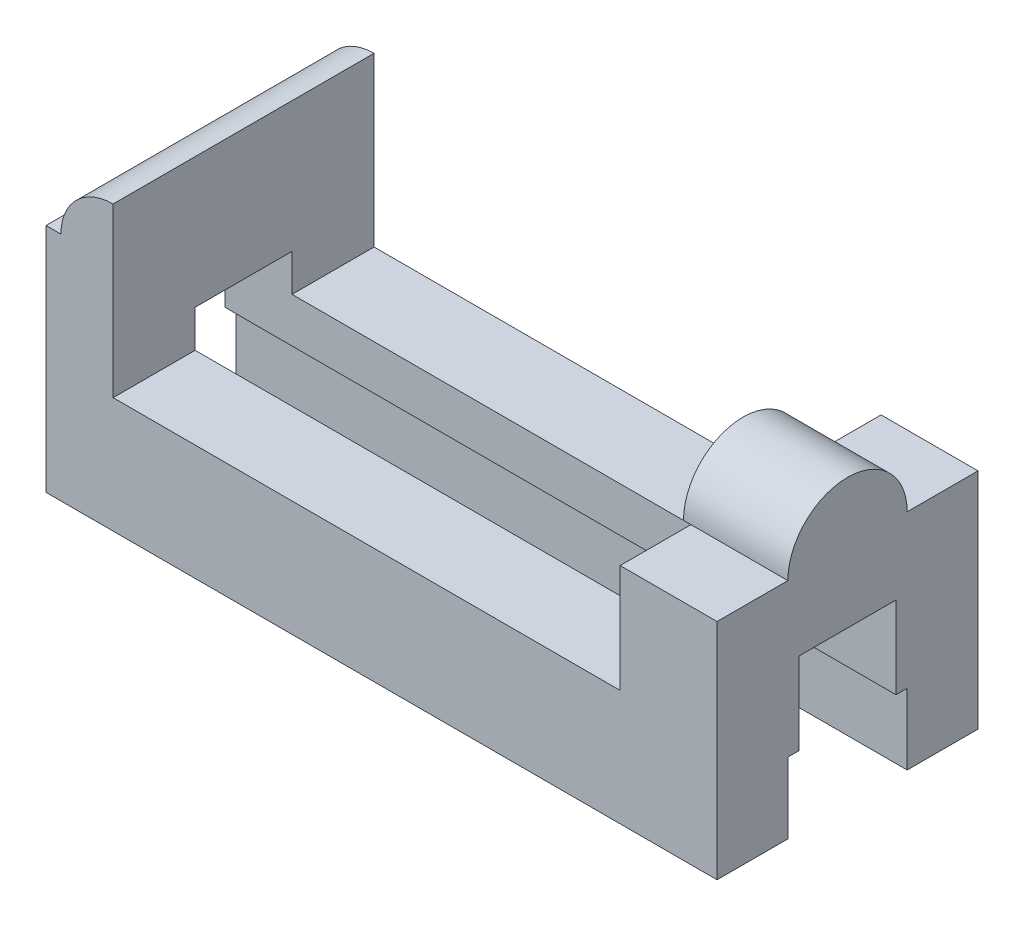
ISO-10303-21;
HEADER;
FILE_DESCRIPTION(('STEP AP214'),'2;1');
FILE_NAME('part.step','',(''),(''),'','','');
FILE_SCHEMA(('AUTOMOTIVE_DESIGN { 1 0 10303 214 1 1 1 1 }'));
ENDSEC;
DATA;
#1=APPLICATION_CONTEXT('core data for automotive mechanical design processes');
#2=APPLICATION_PROTOCOL_DEFINITION('international standard','automotive_design',2000,#1);
#3=PRODUCT_CONTEXT('',#1,'mechanical');
#4=PRODUCT('Part','Part','',(#3));
#5=PRODUCT_RELATED_PRODUCT_CATEGORY('part','',(#4));
#6=PRODUCT_DEFINITION_FORMATION('','',#4);
#7=PRODUCT_DEFINITION_CONTEXT('part definition',#1,'design');
#8=PRODUCT_DEFINITION('design','',#6,#7);
#9=PRODUCT_DEFINITION_SHAPE('','',#8);
#10=(LENGTH_UNIT() NAMED_UNIT(*) SI_UNIT(.MILLI.,.METRE.));
#11=(NAMED_UNIT(*) PLANE_ANGLE_UNIT() SI_UNIT($,.RADIAN.));
#12=(NAMED_UNIT(*) SI_UNIT($,.STERADIAN.) SOLID_ANGLE_UNIT());
#13=UNCERTAINTY_MEASURE_WITH_UNIT(LENGTH_MEASURE(1.E-05),#10,'distance_accuracy_value','');
#14=(GEOMETRIC_REPRESENTATION_CONTEXT(3) GLOBAL_UNCERTAINTY_ASSIGNED_CONTEXT((#13)) GLOBAL_UNIT_ASSIGNED_CONTEXT((#10,
#11,#12)) REPRESENTATION_CONTEXT('',''));
#15=CARTESIAN_POINT('',(0.,0.,0.));
#16=DIRECTION('',(0.,0.,1.));
#17=DIRECTION('',(1.,0.,0.));
#18=AXIS2_PLACEMENT_3D('',#15,#16,#17);
#19=CARTESIAN_POINT('',(20.,22.,35.));
#20=DIRECTION('',(0.,-1.,0.));
#21=DIRECTION('',(0.,0.,-1.));
#22=AXIS2_PLACEMENT_3D('',#19,#20,#21);
#23=PLANE('',#22);
#24=DIRECTION('',(0.,0.,1.));
#25=VECTOR('',#24,1.);
#26=CARTESIAN_POINT('',(64.,22.,35.));
#27=LINE('',#26,#25);
#28=CARTESIAN_POINT('',(64.,22.,-35.));
#29=VERTEX_POINT('',#28);
#30=CARTESIAN_POINT('',(64.,22.,-16.));
#31=VERTEX_POINT('',#30);
#32=EDGE_CURVE('E221',#29,#31,#27,.T.);
#33=ORIENTED_EDGE('',*,*,#32,.T.);
#34=DIRECTION('',(1.,0.,0.));
#35=VECTOR('',#34,1.);
#36=CARTESIAN_POINT('',(62.,22.,-16.));
#37=LINE('',#36,#35);
#38=CARTESIAN_POINT('',(90.,22.,-16.));
#39=VERTEX_POINT('',#38);
#40=EDGE_CURVE('E11',#31,#39,#37,.T.);
#41=ORIENTED_EDGE('',*,*,#40,.T.);
#42=DIRECTION('',(0.,0.,-1.));
#43=VECTOR('',#42,1.);
#44=CARTESIAN_POINT('',(90.,22.,35.));
#45=LINE('',#44,#43);
#46=CARTESIAN_POINT('',(90.,22.,-35.));
#47=VERTEX_POINT('',#46);
#48=EDGE_CURVE('E215',#39,#47,#45,.T.);
#49=ORIENTED_EDGE('',*,*,#48,.T.);
#50=DIRECTION('',(1.,0.,0.));
#51=VECTOR('',#50,1.);
#52=CARTESIAN_POINT('',(0.,22.,-35.));
#53=LINE('',#52,#51);
#54=EDGE_CURVE('E376',#29,#47,#53,.T.);
#55=ORIENTED_EDGE('',*,*,#54,.F.);
#56=EDGE_LOOP('',(#33,#41,#49,#55));
#57=FACE_BOUND('',#56,.T.);
#58=ADVANCED_FACE('F33',(#57),#23,.F.);
#59=CARTESIAN_POINT('',(-90.,-38.,35.));
#60=DIRECTION('',(0.,1.,0.));
#61=DIRECTION('',(0.,0.,1.));
#62=AXIS2_PLACEMENT_3D('',#59,#60,#61);
#63=PLANE('',#62);
#64=DIRECTION('',(0.,0.,-1.));
#65=VECTOR('',#64,1.);
#66=CARTESIAN_POINT('',(-90.,-38.,35.));
#67=LINE('',#66,#65);
#68=CARTESIAN_POINT('',(-90.,-38.,35.));
#69=VERTEX_POINT('',#68);
#70=CARTESIAN_POINT('',(-90.,-38.,16.));
#71=VERTEX_POINT('',#70);
#72=EDGE_CURVE('E359',#69,#71,#67,.T.);
#73=ORIENTED_EDGE('',*,*,#72,.T.);
#74=DIRECTION('',(1.,0.,0.));
#75=VECTOR('',#74,1.);
#76=CARTESIAN_POINT('',(-90.,-38.,16.));
#77=LINE('',#76,#75);
#78=CARTESIAN_POINT('',(89.9999999999999,-38.,16.));
#79=VERTEX_POINT('',#78);
#80=EDGE_CURVE('E261',#71,#79,#77,.T.);
#81=ORIENTED_EDGE('',*,*,#80,.T.);
#82=DIRECTION('',(0.,0.,-1.));
#83=VECTOR('',#82,1.);
#84=CARTESIAN_POINT('',(90.,-38.,35.));
#85=LINE('',#84,#83);
#86=CARTESIAN_POINT('',(90.,-38.,35.));
#87=VERTEX_POINT('',#86);
#88=EDGE_CURVE('E373',#87,#79,#85,.T.);
#89=ORIENTED_EDGE('',*,*,#88,.F.);
#90=DIRECTION('',(1.,0.,0.));
#91=VECTOR('',#90,1.);
#92=CARTESIAN_POINT('',(-90.,-38.,35.));
#93=LINE('',#92,#91);
#94=EDGE_CURVE('E323',#69,#87,#93,.T.);
#95=ORIENTED_EDGE('',*,*,#94,.F.);
#96=EDGE_LOOP('',(#73,#81,#89,#95));
#97=FACE_BOUND('',#96,.T.);
#98=ADVANCED_FACE('F427',(#97),#63,.F.);
#99=CARTESIAN_POINT('',(-72.,-6.99999999999999,35.));
#100=DIRECTION('',(0.,1.,0.));
#101=DIRECTION('',(0.,0.,1.));
#102=AXIS2_PLACEMENT_3D('',#99,#100,#101);
#103=PLANE('',#102);
#104=DIRECTION('',(1.,0.,0.));
#105=VECTOR('',#104,1.);
#106=CARTESIAN_POINT('',(-72.,-6.99999999999999,13.));
#107=LINE('',#106,#105);
#108=CARTESIAN_POINT('',(-72.,-6.99999999999999,13.));
#109=VERTEX_POINT('',#108);
#110=CARTESIAN_POINT('',(64.,-6.99999999999999,13.));
#111=VERTEX_POINT('',#110);
#112=EDGE_CURVE('E309',#109,#111,#107,.T.);
#113=ORIENTED_EDGE('',*,*,#112,.F.);
#114=DIRECTION('',(0.,0.,-1.));
#115=VECTOR('',#114,1.);
#116=CARTESIAN_POINT('',(-72.,-6.99999999999999,35.));
#117=LINE('',#116,#115);
#118=CARTESIAN_POINT('',(-72.,-6.99999999999999,35.));
#119=VERTEX_POINT('',#118);
#120=EDGE_CURVE('E365',#119,#109,#117,.T.);
#121=ORIENTED_EDGE('',*,*,#120,.F.);
#122=DIRECTION('',(1.,0.,0.));
#123=VECTOR('',#122,1.);
#124=CARTESIAN_POINT('',(-72.,-6.99999999999999,35.));
#125=LINE('',#124,#123);
#126=CARTESIAN_POINT('',(64.,-6.99999999999999,35.));
#127=VERTEX_POINT('',#126);
#128=EDGE_CURVE('E333',#119,#127,#125,.T.);
#129=ORIENTED_EDGE('',*,*,#128,.T.);
#130=DIRECTION('',(0.,0.,-1.));
#131=VECTOR('',#130,1.);
#132=CARTESIAN_POINT('',(64.,-6.99999999999999,35.));
#133=LINE('',#132,#131);
#134=EDGE_CURVE('E369',#127,#111,#133,.T.);
#135=ORIENTED_EDGE('',*,*,#134,.T.);
#136=EDGE_LOOP('',(#113,#121,#129,#135));
#137=FACE_BOUND('',#136,.T.);
#138=ADVANCED_FACE('F449',(#137),#103,.T.);
#139=CARTESIAN_POINT('',(89.9999999999999,-38.,-16.));
#140=VERTEX_POINT('',#139);
#141=CARTESIAN_POINT('',(90.,-38.,-35.));
#142=VERTEX_POINT('',#141);
#143=EDGE_CURVE('E372',#140,#142,#85,.T.);
#144=ORIENTED_EDGE('',*,*,#143,.F.);
#145=DIRECTION('',(1.,0.,0.));
#146=VECTOR('',#145,1.);
#147=CARTESIAN_POINT('',(-90.,-38.,-16.));
#148=LINE('',#147,#146);
#149=CARTESIAN_POINT('',(-90.,-38.,-16.));
#150=VERTEX_POINT('',#149);
#151=EDGE_CURVE('E260',#150,#140,#148,.T.);
#152=ORIENTED_EDGE('',*,*,#151,.F.);
#153=CARTESIAN_POINT('',(-90.,-38.,-35.));
#154=VERTEX_POINT('',#153);
#155=EDGE_CURVE('E342',#150,#154,#67,.T.);
#156=ORIENTED_EDGE('',*,*,#155,.T.);
#157=DIRECTION('',(1.,0.,0.));
#158=VECTOR('',#157,1.);
#159=CARTESIAN_POINT('',(-90.,-38.,-35.));
#160=LINE('',#159,#158);
#161=EDGE_CURVE('E322',#154,#142,#160,.T.);
#162=ORIENTED_EDGE('',*,*,#161,.T.);
#163=EDGE_LOOP('',(#144,#152,#156,#162));
#164=FACE_BOUND('',#163,.T.);
#165=ADVANCED_FACE('F35',(#164),#63,.F.);
#166=CARTESIAN_POINT('',(90.,-38.,35.));
#167=DIRECTION('',(-1.,0.,0.));
#168=DIRECTION('',(0.,0.,1.));
#169=AXIS2_PLACEMENT_3D('',#166,#167,#168);
#170=PLANE('',#169);
#171=DIRECTION('',(0.,1.,0.));
#172=VECTOR('',#171,1.);
#173=CARTESIAN_POINT('',(90.,-38.,-35.));
#174=LINE('',#173,#172);
#175=EDGE_CURVE('E345',#142,#47,#174,.T.);
#176=ORIENTED_EDGE('',*,*,#175,.T.);
#177=ORIENTED_EDGE('',*,*,#48,.F.);
#178=CARTESIAN_POINT('',(90.,22.,0.));
#179=DIRECTION('',(1.,0.,0.));
#180=DIRECTION('',(0.,0.,-1.));
#181=AXIS2_PLACEMENT_3D('',#178,#179,#180);
#182=CIRCLE('',#181,16.);
#183=CARTESIAN_POINT('',(90.,22.,16.));
#184=VERTEX_POINT('',#183);
#185=EDGE_CURVE('E208',#39,#184,#182,.T.);
#186=ORIENTED_EDGE('',*,*,#185,.T.);
#187=CARTESIAN_POINT('',(90.,22.,35.));
#188=VERTEX_POINT('',#187);
#189=EDGE_CURVE('E48',#188,#184,#45,.T.);
#190=ORIENTED_EDGE('',*,*,#189,.F.);
#191=DIRECTION('',(0.,1.,0.));
#192=VECTOR('',#191,1.);
#193=CARTESIAN_POINT('',(90.,-38.,35.));
#194=LINE('',#193,#192);
#195=EDGE_CURVE('E326',#87,#188,#194,.T.);
#196=ORIENTED_EDGE('',*,*,#195,.F.);
#197=ORIENTED_EDGE('',*,*,#88,.T.);
#198=DIRECTION('',(0.,1.,0.));
#199=VECTOR('',#198,1.);
#200=CARTESIAN_POINT('',(90.,-38.,16.));
#201=LINE('',#200,#199);
#202=CARTESIAN_POINT('',(89.9999999999999,-19.,16.));
#203=VERTEX_POINT('',#202);
#204=EDGE_CURVE('E319',#79,#203,#201,.T.);
#205=ORIENTED_EDGE('',*,*,#204,.T.);
#206=DIRECTION('',(0.,0.,-1.));
#207=VECTOR('',#206,1.);
#208=CARTESIAN_POINT('',(90.,-19.,35.));
#209=LINE('',#208,#207);
#210=CARTESIAN_POINT('',(89.9999999999999,-19.,13.));
#211=VERTEX_POINT('',#210);
#212=EDGE_CURVE('E316',#203,#211,#209,.T.);
#213=ORIENTED_EDGE('',*,*,#212,.T.);
#214=DIRECTION('',(0.,1.,0.));
#215=VECTOR('',#214,1.);
#216=CARTESIAN_POINT('',(90.,-38.,13.));
#217=LINE('',#216,#215);
#218=CARTESIAN_POINT('',(89.9999999999999,3.,13.));
#219=VERTEX_POINT('',#218);
#220=EDGE_CURVE('E313',#211,#219,#217,.T.);
#221=ORIENTED_EDGE('',*,*,#220,.T.);
#222=DIRECTION('',(0.,0.,-1.));
#223=VECTOR('',#222,1.);
#224=CARTESIAN_POINT('',(90.,3.,35.));
#225=LINE('',#224,#223);
#226=CARTESIAN_POINT('',(89.9999999999999,3.00000000000001,-13.));
#227=VERTEX_POINT('',#226);
#228=EDGE_CURVE('E304',#219,#227,#225,.T.);
#229=ORIENTED_EDGE('',*,*,#228,.T.);
#230=DIRECTION('',(0.,-1.,0.));
#231=VECTOR('',#230,1.);
#232=CARTESIAN_POINT('',(90.,-38.,-13.));
#233=LINE('',#232,#231);
#234=CARTESIAN_POINT('',(89.9999999999999,-19.,-13.));
#235=VERTEX_POINT('',#234);
#236=EDGE_CURVE('E297',#227,#235,#233,.T.);
#237=ORIENTED_EDGE('',*,*,#236,.T.);
#238=DIRECTION('',(0.,0.,-1.));
#239=VECTOR('',#238,1.);
#240=CARTESIAN_POINT('',(90.,-19.,35.));
#241=LINE('',#240,#239);
#242=CARTESIAN_POINT('',(89.9999999999999,-19.,-16.));
#243=VERTEX_POINT('',#242);
#244=EDGE_CURVE('E288',#235,#243,#241,.T.);
#245=ORIENTED_EDGE('',*,*,#244,.T.);
#246=DIRECTION('',(0.,-1.,0.));
#247=VECTOR('',#246,1.);
#248=CARTESIAN_POINT('',(90.,-38.,-16.));
#249=LINE('',#248,#247);
#250=EDGE_CURVE('E264',#243,#140,#249,.T.);
#251=ORIENTED_EDGE('',*,*,#250,.T.);
#252=ORIENTED_EDGE('',*,*,#143,.T.);
#253=EDGE_LOOP('',(#176,#177,#186,#190,#196,#197,#205,#213,#221,#229,#237,#245,#251,#252));
#254=FACE_BOUND('',#253,.T.);
#255=ADVANCED_FACE('F386',(#254),#170,.F.);
#256=CARTESIAN_POINT('',(64.,-6.99999999999999,35.));
#257=DIRECTION('',(-1.,0.,0.));
#258=DIRECTION('',(0.,0.,1.));
#259=AXIS2_PLACEMENT_3D('',#256,#257,#258);
#260=PLANE('',#259);
#261=ORIENTED_EDGE('',*,*,#32,.F.);
#262=DIRECTION('',(0.,1.,0.));
#263=VECTOR('',#262,1.);
#264=CARTESIAN_POINT('',(64.,-6.99999999999999,-35.));
#265=LINE('',#264,#263);
#266=CARTESIAN_POINT('',(64.,-6.99999999999999,-35.));
#267=VERTEX_POINT('',#266);
#268=EDGE_CURVE('E348',#267,#29,#265,.T.);
#269=ORIENTED_EDGE('',*,*,#268,.F.);
#270=CARTESIAN_POINT('',(64.,-6.99999999999999,-13.));
#271=VERTEX_POINT('',#270);
#272=EDGE_CURVE('E368',#271,#267,#133,.T.);
#273=ORIENTED_EDGE('',*,*,#272,.F.);
#274=DIRECTION('',(0.,-1.,0.));
#275=VECTOR('',#274,1.);
#276=CARTESIAN_POINT('',(64.,-6.99999999999999,-13.));
#277=LINE('',#276,#275);
#278=CARTESIAN_POINT('',(63.9999999999999,3.00000000000001,-13.));
#279=VERTEX_POINT('',#278);
#280=EDGE_CURVE('E295',#279,#271,#277,.T.);
#281=ORIENTED_EDGE('',*,*,#280,.F.);
#282=DIRECTION('',(0.,0.,-1.));
#283=VECTOR('',#282,1.);
#284=CARTESIAN_POINT('',(64.,3.,35.));
#285=LINE('',#284,#283);
#286=CARTESIAN_POINT('',(63.9999999999999,3.,13.));
#287=VERTEX_POINT('',#286);
#288=EDGE_CURVE('E302',#287,#279,#285,.T.);
#289=ORIENTED_EDGE('',*,*,#288,.F.);
#290=DIRECTION('',(0.,1.,0.));
#291=VECTOR('',#290,1.);
#292=CARTESIAN_POINT('',(64.,-6.99999999999999,13.));
#293=LINE('',#292,#291);
#294=EDGE_CURVE('E311',#111,#287,#293,.T.);
#295=ORIENTED_EDGE('',*,*,#294,.F.);
#296=ORIENTED_EDGE('',*,*,#134,.F.);
#297=DIRECTION('',(0.,1.,0.));
#298=VECTOR('',#297,1.);
#299=CARTESIAN_POINT('',(64.,-6.99999999999999,35.));
#300=LINE('',#299,#298);
#301=CARTESIAN_POINT('',(64.,22.,35.));
#302=VERTEX_POINT('',#301);
#303=EDGE_CURVE('E330',#127,#302,#300,.T.);
#304=ORIENTED_EDGE('',*,*,#303,.T.);
#305=CARTESIAN_POINT('',(64.,22.,16.));
#306=VERTEX_POINT('',#305);
#307=EDGE_CURVE('E220',#306,#302,#27,.T.);
#308=ORIENTED_EDGE('',*,*,#307,.F.);
#309=EDGE_CURVE('E198',#31,#306,#27,.T.);
#310=ORIENTED_EDGE('',*,*,#309,.F.);
#311=EDGE_LOOP('',(#261,#269,#273,#281,#289,#295,#296,#304,#308,#310));
#312=FACE_BOUND('',#311,.T.);
#313=ADVANCED_FACE('F422',(#312),#260,.T.);
#314=DIRECTION('',(-1.,0.,0.));
#315=VECTOR('',#314,1.);
#316=CARTESIAN_POINT('',(-72.,-6.99999999999999,-13.));
#317=LINE('',#316,#315);
#318=CARTESIAN_POINT('',(-72.,-6.99999999999999,-13.));
#319=VERTEX_POINT('',#318);
#320=EDGE_CURVE('E293',#271,#319,#317,.T.);
#321=ORIENTED_EDGE('',*,*,#320,.F.);
#322=ORIENTED_EDGE('',*,*,#272,.T.);
#323=DIRECTION('',(1.,0.,0.));
#324=VECTOR('',#323,1.);
#325=CARTESIAN_POINT('',(-72.,-6.99999999999999,-35.));
#326=LINE('',#325,#324);
#327=CARTESIAN_POINT('',(-72.,-6.99999999999999,-35.));
#328=VERTEX_POINT('',#327);
#329=EDGE_CURVE('E351',#328,#267,#326,.T.);
#330=ORIENTED_EDGE('',*,*,#329,.F.);
#331=EDGE_CURVE('E364',#319,#328,#117,.T.);
#332=ORIENTED_EDGE('',*,*,#331,.F.);
#333=EDGE_LOOP('',(#321,#322,#330,#332));
#334=FACE_BOUND('',#333,.T.);
#335=ADVANCED_FACE('F418',(#334),#103,.T.);
#336=CARTESIAN_POINT('',(-72.,38.,35.));
#337=DIRECTION('',(1.,0.,0.));
#338=DIRECTION('',(0.,0.,-1.));
#339=AXIS2_PLACEMENT_3D('',#336,#337,#338);
#340=PLANE('',#339);
#341=DIRECTION('',(0.,-1.,0.));
#342=VECTOR('',#341,1.);
#343=CARTESIAN_POINT('',(-72.,38.,13.));
#344=LINE('',#343,#342);
#345=CARTESIAN_POINT('',(-72.,3.,13.));
#346=VERTEX_POINT('',#345);
#347=EDGE_CURVE('E307',#346,#109,#344,.T.);
#348=ORIENTED_EDGE('',*,*,#347,.F.);
#349=DIRECTION('',(0.,0.,1.));
#350=VECTOR('',#349,1.);
#351=CARTESIAN_POINT('',(-72.,3.,35.));
#352=LINE('',#351,#350);
#353=CARTESIAN_POINT('',(-72.,3.00000000000001,-13.));
#354=VERTEX_POINT('',#353);
#355=EDGE_CURVE('E300',#354,#346,#352,.T.);
#356=ORIENTED_EDGE('',*,*,#355,.F.);
#357=DIRECTION('',(0.,1.,0.));
#358=VECTOR('',#357,1.);
#359=CARTESIAN_POINT('',(-72.,38.,-13.));
#360=LINE('',#359,#358);
#361=EDGE_CURVE('E291',#319,#354,#360,.T.);
#362=ORIENTED_EDGE('',*,*,#361,.F.);
#363=ORIENTED_EDGE('',*,*,#331,.T.);
#364=DIRECTION('',(0.,-1.,0.));
#365=VECTOR('',#364,1.);
#366=CARTESIAN_POINT('',(-72.,38.,-35.));
#367=LINE('',#366,#365);
#368=CARTESIAN_POINT('',(-72.,38.,-35.));
#369=VERTEX_POINT('',#368);
#370=EDGE_CURVE('E354',#369,#328,#367,.T.);
#371=ORIENTED_EDGE('',*,*,#370,.F.);
#372=DIRECTION('',(0.,0.,-1.));
#373=VECTOR('',#372,1.);
#374=CARTESIAN_POINT('',(-72.,38.,35.));
#375=LINE('',#374,#373);
#376=CARTESIAN_POINT('',(-72.,38.,35.));
#377=VERTEX_POINT('',#376);
#378=EDGE_CURVE('E362',#377,#369,#375,.T.);
#379=ORIENTED_EDGE('',*,*,#378,.F.);
#380=DIRECTION('',(0.,-1.,0.));
#381=VECTOR('',#380,1.);
#382=CARTESIAN_POINT('',(-72.,38.,35.));
#383=LINE('',#382,#381);
#384=EDGE_CURVE('E336',#377,#119,#383,.T.);
#385=ORIENTED_EDGE('',*,*,#384,.T.);
#386=ORIENTED_EDGE('',*,*,#120,.T.);
#387=EDGE_LOOP('',(#348,#356,#362,#363,#371,#379,#385,#386));
#388=FACE_BOUND('',#387,.T.);
#389=ADVANCED_FACE('F412',(#388),#340,.T.);
#390=CARTESIAN_POINT('',(-90.,-38.,35.));
#391=DIRECTION('',(-1.,0.,0.));
#392=DIRECTION('',(0.,0.,1.));
#393=AXIS2_PLACEMENT_3D('',#390,#391,#392);
#394=PLANE('',#393);
#395=DIRECTION('',(0.,0.,1.));
#396=VECTOR('',#395,1.);
#397=CARTESIAN_POINT('',(-90.,24.,-35.));
#398=LINE('',#397,#396);
#399=CARTESIAN_POINT('',(-90.,24.,-35.));
#400=VERTEX_POINT('',#399);
#401=CARTESIAN_POINT('',(-90.,24.,35.));
#402=VERTEX_POINT('',#401);
#403=EDGE_CURVE('E232',#400,#402,#398,.T.);
#404=ORIENTED_EDGE('',*,*,#403,.F.);
#405=DIRECTION('',(0.,1.,0.));
#406=VECTOR('',#405,1.);
#407=CARTESIAN_POINT('',(-90.,-38.,-35.));
#408=LINE('',#407,#406);
#409=EDGE_CURVE('E327',#154,#400,#408,.T.);
#410=ORIENTED_EDGE('',*,*,#409,.F.);
#411=ORIENTED_EDGE('',*,*,#155,.F.);
#412=DIRECTION('',(0.,1.,0.));
#413=VECTOR('',#412,1.);
#414=CARTESIAN_POINT('',(-90.,-38.,-16.));
#415=LINE('',#414,#413);
#416=CARTESIAN_POINT('',(-90.,-19.,-16.));
#417=VERTEX_POINT('',#416);
#418=EDGE_CURVE('E238',#150,#417,#415,.T.);
#419=ORIENTED_EDGE('',*,*,#418,.T.);
#420=DIRECTION('',(0.,0.,1.));
#421=VECTOR('',#420,1.);
#422=CARTESIAN_POINT('',(-90.,-19.,-16.));
#423=LINE('',#422,#421);
#424=CARTESIAN_POINT('',(-90.,-19.,-13.));
#425=VERTEX_POINT('',#424);
#426=EDGE_CURVE('E242',#417,#425,#423,.T.);
#427=ORIENTED_EDGE('',*,*,#426,.T.);
#428=DIRECTION('',(0.,1.,0.));
#429=VECTOR('',#428,1.);
#430=CARTESIAN_POINT('',(-90.,-19.,-13.));
#431=LINE('',#430,#429);
#432=CARTESIAN_POINT('',(-90.,3.00000000000001,-13.));
#433=VERTEX_POINT('',#432);
#434=EDGE_CURVE('E245',#425,#433,#431,.T.);
#435=ORIENTED_EDGE('',*,*,#434,.T.);
#436=DIRECTION('',(0.,0.,1.));
#437=VECTOR('',#436,1.);
#438=CARTESIAN_POINT('',(-90.,3.00000000000001,-13.));
#439=LINE('',#438,#437);
#440=CARTESIAN_POINT('',(-90.,3.,13.));
#441=VERTEX_POINT('',#440);
#442=EDGE_CURVE('E248',#433,#441,#439,.T.);
#443=ORIENTED_EDGE('',*,*,#442,.T.);
#444=DIRECTION('',(0.,-1.,0.));
#445=VECTOR('',#444,1.);
#446=CARTESIAN_POINT('',(-90.,3.,13.));
#447=LINE('',#446,#445);
#448=CARTESIAN_POINT('',(-90.,-19.,13.));
#449=VERTEX_POINT('',#448);
#450=EDGE_CURVE('E251',#441,#449,#447,.T.);
#451=ORIENTED_EDGE('',*,*,#450,.T.);
#452=DIRECTION('',(0.,0.,1.));
#453=VECTOR('',#452,1.);
#454=CARTESIAN_POINT('',(-90.,-19.,13.));
#455=LINE('',#454,#453);
#456=CARTESIAN_POINT('',(-90.,-19.,16.));
#457=VERTEX_POINT('',#456);
#458=EDGE_CURVE('E254',#449,#457,#455,.T.);
#459=ORIENTED_EDGE('',*,*,#458,.T.);
#460=DIRECTION('',(0.,-1.,0.));
#461=VECTOR('',#460,1.);
#462=CARTESIAN_POINT('',(-90.,-19.,16.));
#463=LINE('',#462,#461);
#464=EDGE_CURVE('E257',#457,#71,#463,.T.);
#465=ORIENTED_EDGE('',*,*,#464,.T.);
#466=ORIENTED_EDGE('',*,*,#72,.F.);
#467=DIRECTION('',(0.,1.,0.));
#468=VECTOR('',#467,1.);
#469=CARTESIAN_POINT('',(-90.,-38.,35.));
#470=LINE('',#469,#468);
#471=EDGE_CURVE('E339',#69,#402,#470,.T.);
#472=ORIENTED_EDGE('',*,*,#471,.T.);
#473=EDGE_LOOP('',(#404,#410,#411,#419,#427,#435,#443,#451,#459,#465,#466,#472));
#474=FACE_BOUND('',#473,.T.);
#475=ADVANCED_FACE('F394',(#474),#394,.T.);
#476=CARTESIAN_POINT('',(0.,0.,35.));
#477=DIRECTION('',(0.,0.,1.));
#478=DIRECTION('',(1.,0.,0.));
#479=AXIS2_PLACEMENT_3D('',#476,#477,#478);
#480=PLANE('',#479);
#481=DIRECTION('',(1.,0.,0.));
#482=VECTOR('',#481,1.);
#483=CARTESIAN_POINT('',(20.,22.,35.));
#484=LINE('',#483,#482);
#485=EDGE_CURVE('E218',#302,#188,#484,.T.);
#486=ORIENTED_EDGE('',*,*,#485,.F.);
#487=ORIENTED_EDGE('',*,*,#303,.F.);
#488=ORIENTED_EDGE('',*,*,#128,.F.);
#489=ORIENTED_EDGE('',*,*,#384,.F.);
#490=CARTESIAN_POINT('',(-72.,24.,35.));
#491=DIRECTION('',(0.,0.,-1.));
#492=DIRECTION('',(-1.,0.,0.));
#493=AXIS2_PLACEMENT_3D('',#490,#491,#492);
#494=CIRCLE('',#493,14.);
#495=CARTESIAN_POINT('',(-86.,24.,35.));
#496=VERTEX_POINT('',#495);
#497=EDGE_CURVE('E229',#496,#377,#494,.T.);
#498=ORIENTED_EDGE('',*,*,#497,.F.);
#499=DIRECTION('',(1.,0.,0.));
#500=VECTOR('',#499,1.);
#501=CARTESIAN_POINT('',(-90.,24.,35.));
#502=LINE('',#501,#500);
#503=EDGE_CURVE('E224',#402,#496,#502,.T.);
#504=ORIENTED_EDGE('',*,*,#503,.F.);
#505=ORIENTED_EDGE('',*,*,#471,.F.);
#506=ORIENTED_EDGE('',*,*,#94,.T.);
#507=ORIENTED_EDGE('',*,*,#195,.T.);
#508=EDGE_LOOP('',(#486,#487,#488,#489,#498,#504,#505,#506,#507));
#509=FACE_BOUND('',#508,.T.);
#510=ADVANCED_FACE('F403',(#509),#480,.T.);
#511=CARTESIAN_POINT('',(0.,0.,-35.));
#512=DIRECTION('',(0.,0.,1.));
#513=DIRECTION('',(1.,0.,0.));
#514=AXIS2_PLACEMENT_3D('',#511,#512,#513);
#515=PLANE('',#514);
#516=ORIENTED_EDGE('',*,*,#268,.T.);
#517=ORIENTED_EDGE('',*,*,#54,.T.);
#518=ORIENTED_EDGE('',*,*,#175,.F.);
#519=ORIENTED_EDGE('',*,*,#161,.F.);
#520=ORIENTED_EDGE('',*,*,#409,.T.);
#521=DIRECTION('',(1.,0.,0.));
#522=VECTOR('',#521,1.);
#523=CARTESIAN_POINT('',(-90.,24.,-35.));
#524=LINE('',#523,#522);
#525=CARTESIAN_POINT('',(-86.,24.,-35.));
#526=VERTEX_POINT('',#525);
#527=EDGE_CURVE('E225',#400,#526,#524,.T.);
#528=ORIENTED_EDGE('',*,*,#527,.T.);
#529=CARTESIAN_POINT('',(-72.,24.,-35.));
#530=DIRECTION('',(0.,0.,-1.));
#531=DIRECTION('',(-1.,0.,0.));
#532=AXIS2_PLACEMENT_3D('',#529,#530,#531);
#533=CIRCLE('',#532,14.);
#534=EDGE_CURVE('E228',#526,#369,#533,.T.);
#535=ORIENTED_EDGE('',*,*,#534,.T.);
#536=ORIENTED_EDGE('',*,*,#370,.T.);
#537=ORIENTED_EDGE('',*,*,#329,.T.);
#538=EDGE_LOOP('',(#516,#517,#518,#519,#520,#528,#535,#536,#537));
#539=FACE_BOUND('',#538,.T.);
#540=ADVANCED_FACE('F380',(#539),#515,.F.);
#541=CARTESIAN_POINT('',(-90.,-19.,16.));
#542=DIRECTION('',(0.,0.,1.));
#543=DIRECTION('',(0.,-1.,0.));
#544=AXIS2_PLACEMENT_3D('',#541,#542,#543);
#545=PLANE('',#544);
#546=ORIENTED_EDGE('',*,*,#80,.F.);
#547=ORIENTED_EDGE('',*,*,#464,.F.);
#548=DIRECTION('',(1.,0.,0.));
#549=VECTOR('',#548,1.);
#550=CARTESIAN_POINT('',(-90.,-19.,16.));
#551=LINE('',#550,#549);
#552=EDGE_CURVE('E265',#457,#203,#551,.T.);
#553=ORIENTED_EDGE('',*,*,#552,.T.);
#554=ORIENTED_EDGE('',*,*,#204,.F.);
#555=EDGE_LOOP('',(#546,#547,#553,#554));
#556=FACE_BOUND('',#555,.T.);
#557=ADVANCED_FACE('F429',(#556),#545,.F.);
#558=CARTESIAN_POINT('',(-90.,-19.,13.));
#559=DIRECTION('',(0.,1.,0.));
#560=DIRECTION('',(0.,0.,1.));
#561=AXIS2_PLACEMENT_3D('',#558,#559,#560);
#562=PLANE('',#561);
#563=ORIENTED_EDGE('',*,*,#552,.F.);
#564=ORIENTED_EDGE('',*,*,#458,.F.);
#565=DIRECTION('',(1.,0.,0.));
#566=VECTOR('',#565,1.);
#567=CARTESIAN_POINT('',(-90.,-19.,13.));
#568=LINE('',#567,#566);
#569=EDGE_CURVE('E268',#449,#211,#568,.T.);
#570=ORIENTED_EDGE('',*,*,#569,.T.);
#571=ORIENTED_EDGE('',*,*,#212,.F.);
#572=EDGE_LOOP('',(#563,#564,#570,#571));
#573=FACE_BOUND('',#572,.T.);
#574=ADVANCED_FACE('F433',(#573),#562,.F.);
#575=CARTESIAN_POINT('',(-90.,3.,13.));
#576=DIRECTION('',(0.,0.,1.));
#577=DIRECTION('',(0.,-1.,0.));
#578=AXIS2_PLACEMENT_3D('',#575,#576,#577);
#579=PLANE('',#578);
#580=ORIENTED_EDGE('',*,*,#569,.F.);
#581=ORIENTED_EDGE('',*,*,#450,.F.);
#582=DIRECTION('',(1.,0.,0.));
#583=VECTOR('',#582,1.);
#584=CARTESIAN_POINT('',(-90.,3.,13.));
#585=LINE('',#584,#583);
#586=EDGE_CURVE('E271',#441,#346,#585,.T.);
#587=ORIENTED_EDGE('',*,*,#586,.T.);
#588=ORIENTED_EDGE('',*,*,#347,.T.);
#589=ORIENTED_EDGE('',*,*,#112,.T.);
#590=ORIENTED_EDGE('',*,*,#294,.T.);
#591=EDGE_CURVE('E274',#287,#219,#585,.T.);
#592=ORIENTED_EDGE('',*,*,#591,.T.);
#593=ORIENTED_EDGE('',*,*,#220,.F.);
#594=EDGE_LOOP('',(#580,#581,#587,#588,#589,#590,#592,#593));
#595=FACE_BOUND('',#594,.T.);
#596=ADVANCED_FACE('F436',(#595),#579,.F.);
#597=CARTESIAN_POINT('',(-90.,3.00000000000001,-13.));
#598=DIRECTION('',(0.,1.,0.));
#599=DIRECTION('',(0.,0.,1.));
#600=AXIS2_PLACEMENT_3D('',#597,#598,#599);
#601=PLANE('',#600);
#602=ORIENTED_EDGE('',*,*,#591,.F.);
#603=ORIENTED_EDGE('',*,*,#288,.T.);
#604=DIRECTION('',(1.,0.,0.));
#605=VECTOR('',#604,1.);
#606=CARTESIAN_POINT('',(-90.,3.00000000000001,-13.));
#607=LINE('',#606,#605);
#608=EDGE_CURVE('E278',#279,#227,#607,.T.);
#609=ORIENTED_EDGE('',*,*,#608,.T.);
#610=ORIENTED_EDGE('',*,*,#228,.F.);
#611=EDGE_LOOP('',(#602,#603,#609,#610));
#612=FACE_BOUND('',#611,.T.);
#613=ADVANCED_FACE('F441',(#612),#601,.F.);
#614=CARTESIAN_POINT('',(-90.,-19.,-13.));
#615=DIRECTION('',(0.,0.,-1.));
#616=DIRECTION('',(0.,1.,0.));
#617=AXIS2_PLACEMENT_3D('',#614,#615,#616);
#618=PLANE('',#617);
#619=ORIENTED_EDGE('',*,*,#608,.F.);
#620=ORIENTED_EDGE('',*,*,#280,.T.);
#621=ORIENTED_EDGE('',*,*,#320,.T.);
#622=ORIENTED_EDGE('',*,*,#361,.T.);
#623=EDGE_CURVE('E275',#433,#354,#607,.T.);
#624=ORIENTED_EDGE('',*,*,#623,.F.);
#625=ORIENTED_EDGE('',*,*,#434,.F.);
#626=DIRECTION('',(1.,0.,0.));
#627=VECTOR('',#626,1.);
#628=CARTESIAN_POINT('',(-90.,-19.,-13.));
#629=LINE('',#628,#627);
#630=EDGE_CURVE('E279',#425,#235,#629,.T.);
#631=ORIENTED_EDGE('',*,*,#630,.T.);
#632=ORIENTED_EDGE('',*,*,#236,.F.);
#633=EDGE_LOOP('',(#619,#620,#621,#622,#624,#625,#631,#632));
#634=FACE_BOUND('',#633,.T.);
#635=ADVANCED_FACE('F445',(#634),#618,.F.);
#636=CARTESIAN_POINT('',(-90.,-19.,-16.));
#637=DIRECTION('',(0.,1.,0.));
#638=DIRECTION('',(0.,0.,1.));
#639=AXIS2_PLACEMENT_3D('',#636,#637,#638);
#640=PLANE('',#639);
#641=ORIENTED_EDGE('',*,*,#630,.F.);
#642=ORIENTED_EDGE('',*,*,#426,.F.);
#643=DIRECTION('',(1.,0.,0.));
#644=VECTOR('',#643,1.);
#645=CARTESIAN_POINT('',(-90.,-19.,-16.));
#646=LINE('',#645,#644);
#647=EDGE_CURVE('E282',#417,#243,#646,.T.);
#648=ORIENTED_EDGE('',*,*,#647,.T.);
#649=ORIENTED_EDGE('',*,*,#244,.F.);
#650=EDGE_LOOP('',(#641,#642,#648,#649));
#651=FACE_BOUND('',#650,.T.);
#652=ADVANCED_FACE('F490',(#651),#640,.F.);
#653=CARTESIAN_POINT('',(-90.,-38.,-16.));
#654=DIRECTION('',(0.,0.,-1.));
#655=DIRECTION('',(-1.,0.,0.));
#656=AXIS2_PLACEMENT_3D('',#653,#654,#655);
#657=PLANE('',#656);
#658=ORIENTED_EDGE('',*,*,#647,.F.);
#659=ORIENTED_EDGE('',*,*,#418,.F.);
#660=ORIENTED_EDGE('',*,*,#151,.T.);
#661=ORIENTED_EDGE('',*,*,#250,.F.);
#662=EDGE_LOOP('',(#658,#659,#660,#661));
#663=FACE_BOUND('',#662,.T.);
#664=ADVANCED_FACE('F486',(#663),#657,.F.);
#665=ORIENTED_EDGE('',*,*,#355,.T.);
#666=ORIENTED_EDGE('',*,*,#586,.F.);
#667=ORIENTED_EDGE('',*,*,#442,.F.);
#668=ORIENTED_EDGE('',*,*,#623,.T.);
#669=EDGE_LOOP('',(#665,#666,#667,#668));
#670=FACE_BOUND('',#669,.T.);
#671=ADVANCED_FACE('F489',(#670),#601,.F.);
#672=CARTESIAN_POINT('',(-72.,24.,-35.));
#673=DIRECTION('',(0.,0.,1.));
#674=DIRECTION('',(1.,0.,0.));
#675=AXIS2_PLACEMENT_3D('',#672,#673,#674);
#676=CYLINDRICAL_SURFACE('',#675,14.);
#677=ORIENTED_EDGE('',*,*,#497,.T.);
#678=ORIENTED_EDGE('',*,*,#378,.T.);
#679=ORIENTED_EDGE('',*,*,#534,.F.);
#680=DIRECTION('',(0.,0.,1.));
#681=VECTOR('',#680,1.);
#682=CARTESIAN_POINT('',(-86.,24.,-35.));
#683=LINE('',#682,#681);
#684=EDGE_CURVE('E236',#526,#496,#683,.T.);
#685=ORIENTED_EDGE('',*,*,#684,.T.);
#686=EDGE_LOOP('',(#677,#678,#679,#685));
#687=FACE_BOUND('',#686,.T.);
#688=ADVANCED_FACE('F408',(#687),#676,.T.);
#689=CARTESIAN_POINT('',(-90.,24.,-35.));
#690=DIRECTION('',(0.,-1.,0.));
#691=DIRECTION('',(0.,0.,-1.));
#692=AXIS2_PLACEMENT_3D('',#689,#690,#691);
#693=PLANE('',#692);
#694=ORIENTED_EDGE('',*,*,#503,.T.);
#695=ORIENTED_EDGE('',*,*,#684,.F.);
#696=ORIENTED_EDGE('',*,*,#527,.F.);
#697=ORIENTED_EDGE('',*,*,#403,.T.);
#698=EDGE_LOOP('',(#694,#695,#696,#697));
#699=FACE_BOUND('',#698,.T.);
#700=ADVANCED_FACE('F398',(#699),#693,.F.);
#701=ORIENTED_EDGE('',*,*,#189,.T.);
#702=DIRECTION('',(1.,0.,0.));
#703=VECTOR('',#702,1.);
#704=CARTESIAN_POINT('',(62.,22.,16.));
#705=LINE('',#704,#703);
#706=EDGE_CURVE('E41',#184,#306,#705,.F.);
#707=ORIENTED_EDGE('',*,*,#706,.T.);
#708=ORIENTED_EDGE('',*,*,#307,.T.);
#709=ORIENTED_EDGE('',*,*,#485,.T.);
#710=EDGE_LOOP('',(#701,#707,#708,#709));
#711=FACE_BOUND('',#710,.T.);
#712=ADVANCED_FACE('F450',(#711),#23,.F.);
#713=CARTESIAN_POINT('',(62.,22.,0.));
#714=DIRECTION('',(1.,0.,0.));
#715=DIRECTION('',(0.,0.,-1.));
#716=AXIS2_PLACEMENT_3D('',#713,#714,#715);
#717=CYLINDRICAL_SURFACE('',#716,16.);
#718=ORIENTED_EDGE('',*,*,#185,.F.);
#719=ORIENTED_EDGE('',*,*,#40,.F.);
#720=DIRECTION('',(1.,0.,0.));
#721=VECTOR('',#720,1.);
#722=CARTESIAN_POINT('',(62.,22.,-16.));
#723=LINE('',#722,#721);
#724=CARTESIAN_POINT('',(62.,22.,-16.));
#725=VERTEX_POINT('',#724);
#726=EDGE_CURVE('E200',#725,#31,#723,.T.);
#727=ORIENTED_EDGE('',*,*,#726,.F.);
#728=CARTESIAN_POINT('',(62.,22.,0.));
#729=DIRECTION('',(1.,0.,0.));
#730=DIRECTION('',(0.,0.,-1.));
#731=AXIS2_PLACEMENT_3D('',#728,#729,#730);
#732=CIRCLE('',#731,16.);
#733=CARTESIAN_POINT('',(62.,22.,16.));
#734=VERTEX_POINT('',#733);
#735=EDGE_CURVE('E203',#725,#734,#732,.T.);
#736=ORIENTED_EDGE('',*,*,#735,.T.);
#737=DIRECTION('',(1.,0.,0.));
#738=VECTOR('',#737,1.);
#739=CARTESIAN_POINT('',(62.,22.,16.));
#740=LINE('',#739,#738);
#741=EDGE_CURVE('E192',#734,#306,#740,.T.);
#742=ORIENTED_EDGE('',*,*,#741,.T.);
#743=ORIENTED_EDGE('',*,*,#706,.F.);
#744=EDGE_LOOP('',(#718,#719,#727,#736,#742,#743));
#745=FACE_BOUND('',#744,.T.);
#746=ADVANCED_FACE('F205',(#745),#717,.T.);
#747=CARTESIAN_POINT('',(62.,22.,16.));
#748=DIRECTION('',(0.,-1.,0.));
#749=DIRECTION('',(0.,0.,-1.));
#750=AXIS2_PLACEMENT_3D('',#747,#748,#749);
#751=PLANE('',#750);
#752=ORIENTED_EDGE('',*,*,#726,.T.);
#753=ORIENTED_EDGE('',*,*,#309,.T.);
#754=ORIENTED_EDGE('',*,*,#741,.F.);
#755=DIRECTION('',(0.,0.,-1.));
#756=VECTOR('',#755,1.);
#757=CARTESIAN_POINT('',(62.,22.,16.));
#758=LINE('',#757,#756);
#759=EDGE_CURVE('E197',#734,#725,#758,.T.);
#760=ORIENTED_EDGE('',*,*,#759,.T.);
#761=EDGE_LOOP('',(#752,#753,#754,#760));
#762=FACE_BOUND('',#761,.T.);
#763=ADVANCED_FACE('F195',(#762),#751,.T.);
#764=CARTESIAN_POINT('',(62.,22.,0.));
#765=DIRECTION('',(1.,0.,0.));
#766=DIRECTION('',(0.,0.,-1.));
#767=AXIS2_PLACEMENT_3D('',#764,#765,#766);
#768=PLANE('',#767);
#769=ORIENTED_EDGE('',*,*,#735,.F.);
#770=ORIENTED_EDGE('',*,*,#759,.F.);
#771=EDGE_LOOP('',(#769,#770));
#772=FACE_BOUND('',#771,.T.);
#773=ADVANCED_FACE('F210',(#772),#768,.F.);
#774=CLOSED_SHELL('',(#58,#98,#138,#165,#255,#313,#335,#389,#475,#510,#540,#557,#574,#596,#613,
#635,#652,#664,#671,#688,#700,#712,#746,#763,#773));
#775=MANIFOLD_SOLID_BREP('B2',#774);
#776=ADVANCED_BREP_SHAPE_REPRESENTATION('',(#18,#775),#14);
#777=SHAPE_DEFINITION_REPRESENTATION(#9,#776);
ENDSEC;
END-ISO-10303-21;
